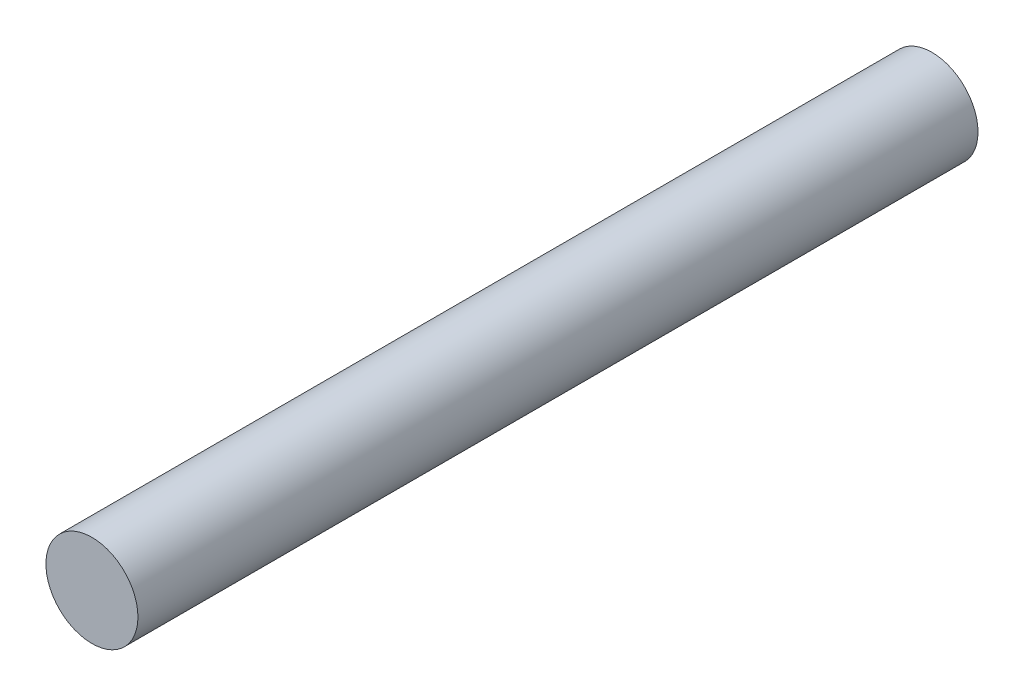
ISO-10303-21;
HEADER;
FILE_DESCRIPTION(('STEP AP214'),'2;1');
FILE_NAME('part.step','',(''),(''),'','','');
FILE_SCHEMA(('AUTOMOTIVE_DESIGN { 1 0 10303 214 1 1 1 1 }'));
ENDSEC;
DATA;
#1=APPLICATION_CONTEXT('core data for automotive mechanical design processes');
#2=APPLICATION_PROTOCOL_DEFINITION('international standard','automotive_design',2000,#1);
#3=PRODUCT_CONTEXT('',#1,'mechanical');
#4=PRODUCT('Part','Part','',(#3));
#5=PRODUCT_RELATED_PRODUCT_CATEGORY('part','',(#4));
#6=PRODUCT_DEFINITION_FORMATION('','',#4);
#7=PRODUCT_DEFINITION_CONTEXT('part definition',#1,'design');
#8=PRODUCT_DEFINITION('design','',#6,#7);
#9=PRODUCT_DEFINITION_SHAPE('','',#8);
#10=(LENGTH_UNIT() NAMED_UNIT(*) SI_UNIT(.MILLI.,.METRE.));
#11=(NAMED_UNIT(*) PLANE_ANGLE_UNIT() SI_UNIT($,.RADIAN.));
#12=(NAMED_UNIT(*) SI_UNIT($,.STERADIAN.) SOLID_ANGLE_UNIT());
#13=UNCERTAINTY_MEASURE_WITH_UNIT(LENGTH_MEASURE(1.E-05),#10,'distance_accuracy_value','');
#14=(GEOMETRIC_REPRESENTATION_CONTEXT(3) GLOBAL_UNCERTAINTY_ASSIGNED_CONTEXT((#13)) GLOBAL_UNIT_ASSIGNED_CONTEXT((#10,
#11,#12)) REPRESENTATION_CONTEXT('',''));
#15=CARTESIAN_POINT('',(0.,0.,0.));
#16=DIRECTION('',(0.,0.,1.));
#17=DIRECTION('',(1.,0.,0.));
#18=AXIS2_PLACEMENT_3D('',#15,#16,#17);
#19=CARTESIAN_POINT('',(1.11022302462516E-13,0.,-73.6362817331761));
#20=DIRECTION('',(0.,0.,1.));
#21=DIRECTION('',(1.,0.,0.));
#22=AXIS2_PLACEMENT_3D('',#19,#20,#21);
#23=CYLINDRICAL_SURFACE('',#22,3.49250000000001);
#24=CARTESIAN_POINT('',(1.11022302462516E-13,0.,-63.758));
#25=DIRECTION('',(0.,0.,1.));
#26=DIRECTION('',(1.,0.,0.));
#27=AXIS2_PLACEMENT_3D('',#24,#25,#26);
#28=CIRCLE('',#27,3.49250000000001);
#29=CARTESIAN_POINT('',(3.49250000000012,0.,-63.758));
#30=VERTEX_POINT('',#29);
#31=EDGE_CURVE('E10',#30,#30,#28,.F.);
#32=ORIENTED_EDGE('',*,*,#31,.F.);
#33=EDGE_LOOP('',(#32));
#34=FACE_BOUND('',#33,.T.);
#35=CARTESIAN_POINT('',(1.11022302462516E-13,0.,0.));
#36=DIRECTION('',(0.,0.,1.));
#37=DIRECTION('',(1.,0.,0.));
#38=AXIS2_PLACEMENT_3D('',#35,#36,#37);
#39=CIRCLE('',#38,3.49250000000001);
#40=CARTESIAN_POINT('',(3.49250000000012,0.,0.));
#41=VERTEX_POINT('',#40);
#42=EDGE_CURVE('E44',#41,#41,#39,.T.);
#43=ORIENTED_EDGE('',*,*,#42,.F.);
#44=EDGE_LOOP('',(#43));
#45=FACE_BOUND('',#44,.T.);
#46=ADVANCED_FACE('F37',(#34,#45),#23,.T.);
#47=CARTESIAN_POINT('',(1.11022302462516E-13,0.,0.));
#48=DIRECTION('',(0.,0.,1.));
#49=DIRECTION('',(1.,0.,0.));
#50=AXIS2_PLACEMENT_3D('',#47,#48,#49);
#51=PLANE('',#50);
#52=ORIENTED_EDGE('',*,*,#42,.T.);
#53=EDGE_LOOP('',(#52));
#54=FACE_BOUND('',#53,.T.);
#55=ADVANCED_FACE('F51',(#54),#51,.T.);
#56=CARTESIAN_POINT('',(1.12573223312595E-13,0.,-63.758));
#57=DIRECTION('',(0.,0.,1.));
#58=DIRECTION('',(-1.,0.,0.));
#59=AXIS2_PLACEMENT_3D('',#56,#57,#58);
#60=PLANE('',#59);
#61=ORIENTED_EDGE('',*,*,#31,.T.);
#62=EDGE_LOOP('',(#61));
#63=FACE_BOUND('',#62,.T.);
#64=ADVANCED_FACE('F58',(#63),#60,.F.);
#65=CLOSED_SHELL('',(#46,#55,#64));
#66=MANIFOLD_SOLID_BREP('B2',#65);
#67=ADVANCED_BREP_SHAPE_REPRESENTATION('',(#18,#66),#14);
#68=SHAPE_DEFINITION_REPRESENTATION(#9,#67);
ENDSEC;
END-ISO-10303-21;
